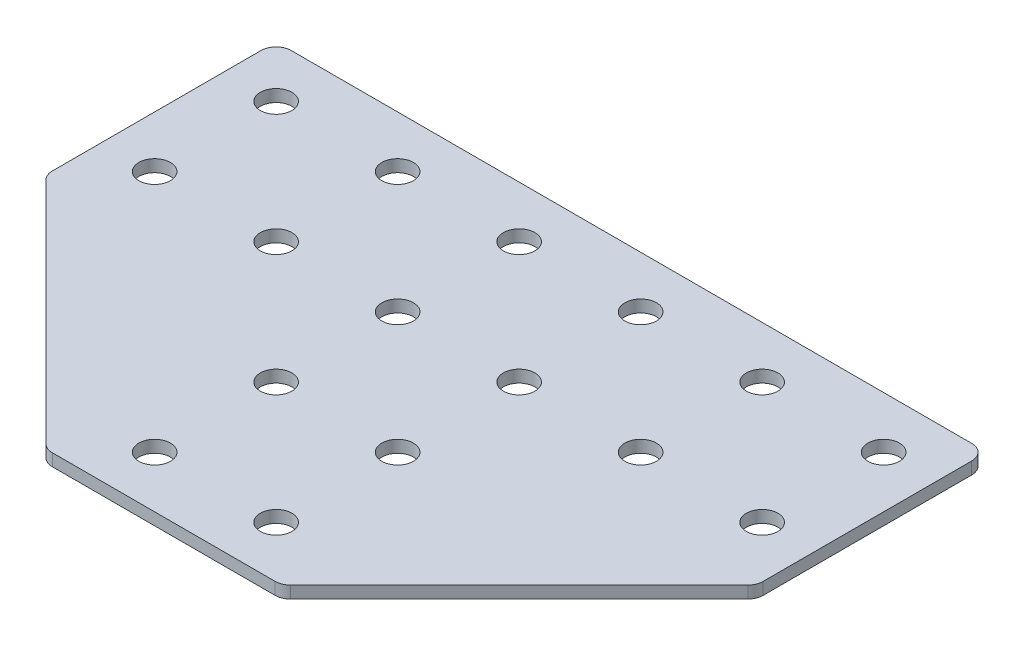
ISO-10303-21;
HEADER;
FILE_DESCRIPTION(('STEP AP214'),'2;1');
FILE_NAME('part.step','',(''),(''),'','','');
FILE_SCHEMA(('AUTOMOTIVE_DESIGN { 1 0 10303 214 1 1 1 1 }'));
ENDSEC;
DATA;
#1=APPLICATION_CONTEXT('core data for automotive mechanical design processes');
#2=APPLICATION_PROTOCOL_DEFINITION('international standard','automotive_design',2000,#1);
#3=PRODUCT_CONTEXT('',#1,'mechanical');
#4=PRODUCT('Part','Part','',(#3));
#5=PRODUCT_RELATED_PRODUCT_CATEGORY('part','',(#4));
#6=PRODUCT_DEFINITION_FORMATION('','',#4);
#7=PRODUCT_DEFINITION_CONTEXT('part definition',#1,'design');
#8=PRODUCT_DEFINITION('design','',#6,#7);
#9=PRODUCT_DEFINITION_SHAPE('','',#8);
#10=(LENGTH_UNIT() NAMED_UNIT(*) SI_UNIT(.MILLI.,.METRE.));
#11=(NAMED_UNIT(*) PLANE_ANGLE_UNIT() SI_UNIT($,.RADIAN.));
#12=(NAMED_UNIT(*) SI_UNIT($,.STERADIAN.) SOLID_ANGLE_UNIT());
#13=UNCERTAINTY_MEASURE_WITH_UNIT(LENGTH_MEASURE(1.E-05),#10,'distance_accuracy_value','');
#14=(GEOMETRIC_REPRESENTATION_CONTEXT(3) GLOBAL_UNCERTAINTY_ASSIGNED_CONTEXT((#13)) GLOBAL_UNIT_ASSIGNED_CONTEXT((#10,
#11,#12)) REPRESENTATION_CONTEXT('',''));
#15=CARTESIAN_POINT('',(0.,0.,0.));
#16=DIRECTION('',(0.,0.,1.));
#17=DIRECTION('',(1.,0.,0.));
#18=AXIS2_PLACEMENT_3D('',#15,#16,#17);
#19=CARTESIAN_POINT('',(-1.58311926747956,0.841431359707713,-20.2580128323757));
#20=DIRECTION('',(0.,-1.,0.));
#21=DIRECTION('',(0.,0.,-1.));
#22=AXIS2_PLACEMENT_3D('',#19,#20,#21);
#23=PLANE('',#22);
#24=DIRECTION('',(1.,0.,0.));
#25=VECTOR('',#24,1.);
#26=CARTESIAN_POINT('',(-20.0831192674796,0.841431359707713,38.2419871676243));
#27=LINE('',#26,#25);
#28=CARTESIAN_POINT('',(-19.9262650179872,0.841431359707713,38.2419871676243));
#29=VERTEX_POINT('',#28);
#30=CARTESIAN_POINT('',(16.7600264830281,0.841431359707713,38.2419871676243));
#31=VERTEX_POINT('',#30);
#32=EDGE_CURVE('E218',#29,#31,#27,.T.);
#33=ORIENTED_EDGE('',*,*,#32,.F.);
#34=CARTESIAN_POINT('',(-19.9262650179872,0.841431359707713,35.7419871676243));
#35=DIRECTION('',(0.,1.,0.));
#36=DIRECTION('',(0.,0.,-1.));
#37=AXIS2_PLACEMENT_3D('',#34,#35,#36);
#38=CIRCLE('',#37,2.5);
#39=CARTESIAN_POINT('',(-21.6940319709536,0.841431359707713,37.5097541205907));
#40=VERTEX_POINT('',#39);
#41=EDGE_CURVE('E154',#40,#29,#38,.T.);
#42=ORIENTED_EDGE('',*,*,#41,.F.);
#43=DIRECTION('',(-0.707106781186547,0.,-0.707106781186548));
#44=VECTOR('',#43,1.);
#45=CARTESIAN_POINT('',(-20.96179892392,0.841431359707713,38.2419871676243));
#46=LINE('',#45,#44);
#47=CARTESIAN_POINT('',(-59.3508862204459,0.841431359707713,-0.147100128901612));
#48=VERTEX_POINT('',#47);
#49=EDGE_CURVE('E141',#40,#48,#46,.T.);
#50=ORIENTED_EDGE('',*,*,#49,.T.);
#51=CARTESIAN_POINT('',(-57.5831192674795,0.841431359707713,-1.91486708186799));
#52=DIRECTION('',(0.,1.,0.));
#53=DIRECTION('',(0.,0.,-1.));
#54=AXIS2_PLACEMENT_3D('',#51,#52,#53);
#55=CIRCLE('',#54,2.5);
#56=CARTESIAN_POINT('',(-60.0831192674795,0.841431359707713,-1.91486708186798));
#57=VERTEX_POINT('',#56);
#58=EDGE_CURVE('E152',#57,#48,#55,.T.);
#59=ORIENTED_EDGE('',*,*,#58,.F.);
#60=DIRECTION('',(0.,0.,-1.));
#61=VECTOR('',#60,1.);
#62=CARTESIAN_POINT('',(-60.0831192674795,0.841431359707713,-0.879333175935252));
#63=LINE('',#62,#61);
#64=CARTESIAN_POINT('',(-60.0831192674795,0.841431359707713,-36.2580128323757));
#65=VERTEX_POINT('',#64);
#66=EDGE_CURVE('E124',#57,#65,#63,.T.);
#67=ORIENTED_EDGE('',*,*,#66,.T.);
#68=CARTESIAN_POINT('',(-57.5831192674795,0.841431359707713,-36.2580128323757));
#69=DIRECTION('',(0.,1.,0.));
#70=DIRECTION('',(0.,0.,-1.));
#71=AXIS2_PLACEMENT_3D('',#68,#69,#70);
#72=CIRCLE('',#71,2.5);
#73=CARTESIAN_POINT('',(-57.5831192674795,0.841431359707713,-38.7580128323757));
#74=VERTEX_POINT('',#73);
#75=EDGE_CURVE('E149',#74,#65,#72,.T.);
#76=ORIENTED_EDGE('',*,*,#75,.F.);
#77=DIRECTION('',(-1.,0.,0.));
#78=VECTOR('',#77,1.);
#79=CARTESIAN_POINT('',(56.9168807325204,0.841431359707713,-38.7580128323757));
#80=LINE('',#79,#78);
#81=CARTESIAN_POINT('',(54.4168807325204,0.841431359707713,-38.7580128323757));
#82=VERTEX_POINT('',#81);
#83=EDGE_CURVE('E215',#82,#74,#80,.T.);
#84=ORIENTED_EDGE('',*,*,#83,.F.);
#85=CARTESIAN_POINT('',(54.4168807325204,0.841431359707713,-36.2580128323757));
#86=DIRECTION('',(0.,-1.,0.));
#87=DIRECTION('',(0.,0.,-1.));
#88=AXIS2_PLACEMENT_3D('',#85,#86,#87);
#89=CIRCLE('',#88,2.5);
#90=CARTESIAN_POINT('',(56.9168807325204,0.841431359707713,-36.2580128323757));
#91=VERTEX_POINT('',#90);
#92=EDGE_CURVE('E239',#82,#91,#89,.T.);
#93=ORIENTED_EDGE('',*,*,#92,.T.);
#94=DIRECTION('',(0.,0.,-1.));
#95=VECTOR('',#94,1.);
#96=CARTESIAN_POINT('',(56.9168807325204,0.841431359707713,-0.879333175935269));
#97=LINE('',#96,#95);
#98=CARTESIAN_POINT('',(56.9168807325204,0.841431359707713,-1.914867081868));
#99=VERTEX_POINT('',#98);
#100=EDGE_CURVE('E212',#99,#91,#97,.T.);
#101=ORIENTED_EDGE('',*,*,#100,.F.);
#102=CARTESIAN_POINT('',(54.4168807325204,0.841431359707713,-1.914867081868));
#103=DIRECTION('',(0.,-1.,0.));
#104=DIRECTION('',(0.,0.,-1.));
#105=AXIS2_PLACEMENT_3D('',#102,#103,#104);
#106=CIRCLE('',#105,2.5);
#107=CARTESIAN_POINT('',(56.1846476854867,0.841431359707713,-0.14710012890163));
#108=VERTEX_POINT('',#107);
#109=EDGE_CURVE('E31',#99,#108,#106,.T.);
#110=ORIENTED_EDGE('',*,*,#109,.T.);
#111=DIRECTION('',(0.707106781186547,0.,-0.707106781186548));
#112=VECTOR('',#111,1.);
#113=CARTESIAN_POINT('',(17.7955603889609,0.841431359707713,38.2419871676243));
#114=LINE('',#113,#112);
#115=CARTESIAN_POINT('',(18.5277934359945,0.841431359707713,37.5097541205907));
#116=VERTEX_POINT('',#115);
#117=EDGE_CURVE('E220',#116,#108,#114,.T.);
#118=ORIENTED_EDGE('',*,*,#117,.F.);
#119=CARTESIAN_POINT('',(16.7600264830281,0.841431359707713,35.7419871676243));
#120=DIRECTION('',(0.,-1.,0.));
#121=DIRECTION('',(0.,0.,-1.));
#122=AXIS2_PLACEMENT_3D('',#119,#120,#121);
#123=CIRCLE('',#122,2.5);
#124=EDGE_CURVE('E242',#116,#31,#123,.T.);
#125=ORIENTED_EDGE('',*,*,#124,.T.);
#126=EDGE_LOOP('',(#33,#42,#50,#59,#67,#76,#84,#93,#101,#110,#118,#125));
#127=FACE_BOUND('',#126,.T.);
#128=CARTESIAN_POINT('',(48.4168807325204,0.841431359707713,-10.2580128323757));
#129=DIRECTION('',(0.,1.,0.));
#130=DIRECTION('',(0.,0.,1.));
#131=AXIS2_PLACEMENT_3D('',#128,#129,#130);
#132=CIRCLE('',#131,2.6);
#133=CARTESIAN_POINT('',(48.4168807325204,0.841431359707713,-7.65801283237568));
#134=VERTEX_POINT('',#133);
#135=EDGE_CURVE('E164',#134,#134,#132,.T.);
#136=ORIENTED_EDGE('',*,*,#135,.T.);
#137=EDGE_LOOP('',(#136));
#138=FACE_BOUND('',#137,.T.);
#139=CARTESIAN_POINT('',(28.4168807325204,0.841431359707713,-10.2580128323757));
#140=DIRECTION('',(0.,1.,0.));
#141=DIRECTION('',(0.,0.,1.));
#142=AXIS2_PLACEMENT_3D('',#139,#140,#141);
#143=CIRCLE('',#142,2.6);
#144=CARTESIAN_POINT('',(28.4168807325204,0.841431359707713,-7.65801283237565));
#145=VERTEX_POINT('',#144);
#146=EDGE_CURVE('E170',#145,#145,#143,.T.);
#147=ORIENTED_EDGE('',*,*,#146,.T.);
#148=EDGE_LOOP('',(#147));
#149=FACE_BOUND('',#148,.T.);
#150=CARTESIAN_POINT('',(8.41688073252045,0.841431359707713,29.7419871676243));
#151=DIRECTION('',(0.,1.,0.));
#152=DIRECTION('',(0.,0.,1.));
#153=AXIS2_PLACEMENT_3D('',#150,#151,#152);
#154=CIRCLE('',#153,2.6);
#155=CARTESIAN_POINT('',(8.41688073252045,0.841431359707713,32.3419871676243));
#156=VERTEX_POINT('',#155);
#157=EDGE_CURVE('E176',#156,#156,#154,.T.);
#158=ORIENTED_EDGE('',*,*,#157,.T.);
#159=EDGE_LOOP('',(#158));
#160=FACE_BOUND('',#159,.T.);
#161=CARTESIAN_POINT('',(8.41688073252045,0.841431359707713,9.74198716762433));
#162=DIRECTION('',(0.,1.,0.));
#163=DIRECTION('',(0.,0.,1.));
#164=AXIS2_PLACEMENT_3D('',#161,#162,#163);
#165=CIRCLE('',#164,2.6);
#166=CARTESIAN_POINT('',(8.41688073252045,0.841431359707713,12.3419871676243));
#167=VERTEX_POINT('',#166);
#168=EDGE_CURVE('E182',#167,#167,#165,.T.);
#169=ORIENTED_EDGE('',*,*,#168,.T.);
#170=EDGE_LOOP('',(#169));
#171=FACE_BOUND('',#170,.T.);
#172=CARTESIAN_POINT('',(8.41688073252041,0.841431359707713,-10.2580128323757));
#173=DIRECTION('',(0.,1.,0.));
#174=DIRECTION('',(0.,0.,1.));
#175=AXIS2_PLACEMENT_3D('',#172,#173,#174);
#176=CIRCLE('',#175,2.6);
#177=CARTESIAN_POINT('',(8.41688073252041,0.841431359707713,-7.65801283237566));
#178=VERTEX_POINT('',#177);
#179=EDGE_CURVE('E188',#178,#178,#176,.T.);
#180=ORIENTED_EDGE('',*,*,#179,.T.);
#181=EDGE_LOOP('',(#180));
#182=FACE_BOUND('',#181,.T.);
#183=CARTESIAN_POINT('',(48.4168807325204,0.841431359707713,-30.2580128323757));
#184=DIRECTION('',(0.,1.,0.));
#185=DIRECTION('',(0.,0.,1.));
#186=AXIS2_PLACEMENT_3D('',#183,#184,#185);
#187=CIRCLE('',#186,2.6);
#188=CARTESIAN_POINT('',(48.4168807325204,0.841431359707713,-27.6580128323757));
#189=VERTEX_POINT('',#188);
#190=EDGE_CURVE('E194',#189,#189,#187,.T.);
#191=ORIENTED_EDGE('',*,*,#190,.T.);
#192=EDGE_LOOP('',(#191));
#193=FACE_BOUND('',#192,.T.);
#194=CARTESIAN_POINT('',(28.4168807325204,0.841431359707713,-30.2580128323757));
#195=DIRECTION('',(0.,1.,0.));
#196=DIRECTION('',(0.,0.,1.));
#197=AXIS2_PLACEMENT_3D('',#194,#195,#196);
#198=CIRCLE('',#197,2.6);
#199=CARTESIAN_POINT('',(28.4168807325204,0.841431359707713,-27.6580128323757));
#200=VERTEX_POINT('',#199);
#201=EDGE_CURVE('E200',#200,#200,#198,.T.);
#202=ORIENTED_EDGE('',*,*,#201,.T.);
#203=EDGE_LOOP('',(#202));
#204=FACE_BOUND('',#203,.T.);
#205=CARTESIAN_POINT('',(8.41688073252041,0.841431359707713,-30.2580128323757));
#206=DIRECTION('',(0.,1.,0.));
#207=DIRECTION('',(0.,0.,1.));
#208=AXIS2_PLACEMENT_3D('',#205,#206,#207);
#209=CIRCLE('',#208,2.6);
#210=CARTESIAN_POINT('',(8.41688073252041,0.841431359707713,-27.6580128323757));
#211=VERTEX_POINT('',#210);
#212=EDGE_CURVE('E206',#211,#211,#209,.T.);
#213=ORIENTED_EDGE('',*,*,#212,.T.);
#214=EDGE_LOOP('',(#213));
#215=FACE_BOUND('',#214,.T.);
#216=CARTESIAN_POINT('',(-51.5831192674795,0.841431359707713,-10.2580128323757));
#217=DIRECTION('',(0.,-1.,0.));
#218=DIRECTION('',(0.,0.,1.));
#219=AXIS2_PLACEMENT_3D('',#216,#217,#218);
#220=CIRCLE('',#219,2.6);
#221=CARTESIAN_POINT('',(-51.5831192674795,0.841431359707713,-7.65801283237567));
#222=VERTEX_POINT('',#221);
#223=EDGE_CURVE('E318',#222,#222,#220,.T.);
#224=ORIENTED_EDGE('',*,*,#223,.F.);
#225=EDGE_LOOP('',(#224));
#226=FACE_BOUND('',#225,.T.);
#227=CARTESIAN_POINT('',(-31.5831192674795,0.841431359707713,-10.2580128323756));
#228=DIRECTION('',(0.,-1.,0.));
#229=DIRECTION('',(0.,0.,1.));
#230=AXIS2_PLACEMENT_3D('',#227,#228,#229);
#231=CIRCLE('',#230,2.6);
#232=CARTESIAN_POINT('',(-31.5831192674795,0.841431359707713,-7.65801283237565));
#233=VERTEX_POINT('',#232);
#234=EDGE_CURVE('E312',#233,#233,#231,.T.);
#235=ORIENTED_EDGE('',*,*,#234,.F.);
#236=EDGE_LOOP('',(#235));
#237=FACE_BOUND('',#236,.T.);
#238=CARTESIAN_POINT('',(-11.5831192674795,0.841431359707713,29.7419871676243));
#239=DIRECTION('',(0.,-1.,0.));
#240=DIRECTION('',(0.,0.,1.));
#241=AXIS2_PLACEMENT_3D('',#238,#239,#240);
#242=CIRCLE('',#241,2.6);
#243=CARTESIAN_POINT('',(-11.5831192674795,0.841431359707713,32.3419871676243));
#244=VERTEX_POINT('',#243);
#245=EDGE_CURVE('E306',#244,#244,#242,.T.);
#246=ORIENTED_EDGE('',*,*,#245,.F.);
#247=EDGE_LOOP('',(#246));
#248=FACE_BOUND('',#247,.T.);
#249=CARTESIAN_POINT('',(-11.5831192674796,0.841431359707713,9.74198716762433));
#250=DIRECTION('',(0.,-1.,0.));
#251=DIRECTION('',(0.,0.,1.));
#252=AXIS2_PLACEMENT_3D('',#249,#250,#251);
#253=CIRCLE('',#252,2.6);
#254=CARTESIAN_POINT('',(-11.5831192674796,0.841431359707713,12.3419871676243));
#255=VERTEX_POINT('',#254);
#256=EDGE_CURVE('E300',#255,#255,#253,.T.);
#257=ORIENTED_EDGE('',*,*,#256,.F.);
#258=EDGE_LOOP('',(#257));
#259=FACE_BOUND('',#258,.T.);
#260=CARTESIAN_POINT('',(-11.5831192674795,0.841431359707713,-10.2580128323757));
#261=DIRECTION('',(0.,-1.,0.));
#262=DIRECTION('',(0.,0.,1.));
#263=AXIS2_PLACEMENT_3D('',#260,#261,#262);
#264=CIRCLE('',#263,2.6);
#265=CARTESIAN_POINT('',(-11.5831192674795,0.841431359707713,-7.65801283237565));
#266=VERTEX_POINT('',#265);
#267=EDGE_CURVE('E294',#266,#266,#264,.T.);
#268=ORIENTED_EDGE('',*,*,#267,.F.);
#269=EDGE_LOOP('',(#268));
#270=FACE_BOUND('',#269,.T.);
#271=CARTESIAN_POINT('',(-51.5831192674795,0.841431359707713,-30.2580128323756));
#272=DIRECTION('',(0.,-1.,0.));
#273=DIRECTION('',(0.,0.,1.));
#274=AXIS2_PLACEMENT_3D('',#271,#272,#273);
#275=CIRCLE('',#274,2.6);
#276=CARTESIAN_POINT('',(-51.5831192674795,0.841431359707713,-27.6580128323756));
#277=VERTEX_POINT('',#276);
#278=EDGE_CURVE('E288',#277,#277,#275,.T.);
#279=ORIENTED_EDGE('',*,*,#278,.F.);
#280=EDGE_LOOP('',(#279));
#281=FACE_BOUND('',#280,.T.);
#282=CARTESIAN_POINT('',(-31.5831192674795,0.841431359707713,-30.2580128323756));
#283=DIRECTION('',(0.,-1.,0.));
#284=DIRECTION('',(0.,0.,1.));
#285=AXIS2_PLACEMENT_3D('',#282,#283,#284);
#286=CIRCLE('',#285,2.6);
#287=CARTESIAN_POINT('',(-31.5831192674795,0.841431359707713,-27.6580128323756));
#288=VERTEX_POINT('',#287);
#289=EDGE_CURVE('E283',#288,#288,#286,.T.);
#290=ORIENTED_EDGE('',*,*,#289,.F.);
#291=EDGE_LOOP('',(#290));
#292=FACE_BOUND('',#291,.T.);
#293=CARTESIAN_POINT('',(-11.5831192674795,0.841431359707713,-30.2580128323757));
#294=DIRECTION('',(0.,-1.,0.));
#295=DIRECTION('',(0.,0.,1.));
#296=AXIS2_PLACEMENT_3D('',#293,#294,#295);
#297=CIRCLE('',#296,2.6);
#298=CARTESIAN_POINT('',(-11.5831192674795,0.841431359707713,-27.6580128323757));
#299=VERTEX_POINT('',#298);
#300=EDGE_CURVE('E134',#299,#299,#297,.T.);
#301=ORIENTED_EDGE('',*,*,#300,.F.);
#302=EDGE_LOOP('',(#301));
#303=FACE_BOUND('',#302,.T.);
#304=ADVANCED_FACE('F16',(#127,#138,#149,#160,#171,#182,#193,#204,#215,#226,#237,#248,#259,#270,
#281,#292,#303),#23,.T.);
#305=CARTESIAN_POINT('',(56.9168807325204,0.841431359707713,-0.879333175935269));
#306=DIRECTION('',(1.,0.,0.));
#307=DIRECTION('',(0.,0.,-1.));
#308=AXIS2_PLACEMENT_3D('',#305,#306,#307);
#309=PLANE('',#308);
#310=DIRECTION('',(0.,0.,-1.));
#311=VECTOR('',#310,1.);
#312=CARTESIAN_POINT('',(56.9168807325204,2.84143135970771,-0.879333175935269));
#313=LINE('',#312,#311);
#314=CARTESIAN_POINT('',(56.9168807325204,2.84143135970771,-1.914867081868));
#315=VERTEX_POINT('',#314);
#316=CARTESIAN_POINT('',(56.9168807325204,2.84143135970771,-36.2580128323757));
#317=VERTEX_POINT('',#316);
#318=EDGE_CURVE('E209',#315,#317,#313,.T.);
#319=ORIENTED_EDGE('',*,*,#318,.F.);
#320=DIRECTION('',(0.,1.,0.));
#321=VECTOR('',#320,1.);
#322=CARTESIAN_POINT('',(56.9168807325204,0.841431359707713,-1.914867081868));
#323=LINE('',#322,#321);
#324=EDGE_CURVE('E24',#315,#99,#323,.F.);
#325=ORIENTED_EDGE('',*,*,#324,.T.);
#326=ORIENTED_EDGE('',*,*,#100,.T.);
#327=DIRECTION('',(0.,1.,0.));
#328=VECTOR('',#327,1.);
#329=CARTESIAN_POINT('',(56.9168807325204,0.841431359707713,-36.2580128323757));
#330=LINE('',#329,#328);
#331=EDGE_CURVE('E249',#91,#317,#330,.T.);
#332=ORIENTED_EDGE('',*,*,#331,.T.);
#333=EDGE_LOOP('',(#319,#325,#326,#332));
#334=FACE_BOUND('',#333,.T.);
#335=ADVANCED_FACE('F254',(#334),#309,.T.);
#336=CARTESIAN_POINT('',(17.7955603889609,0.841431359707713,38.2419871676243));
#337=DIRECTION('',(0.707106781186548,0.,0.707106781186547));
#338=DIRECTION('',(0.707106781186547,0.,-0.707106781186548));
#339=AXIS2_PLACEMENT_3D('',#336,#337,#338);
#340=PLANE('',#339);
#341=DIRECTION('',(0.707106781186547,0.,-0.707106781186548));
#342=VECTOR('',#341,1.);
#343=CARTESIAN_POINT('',(17.7955603889609,2.84143135970771,38.2419871676243));
#344=LINE('',#343,#342);
#345=CARTESIAN_POINT('',(18.5277934359945,2.84143135970771,37.5097541205907));
#346=VERTEX_POINT('',#345);
#347=CARTESIAN_POINT('',(56.1846476854867,2.84143135970771,-0.14710012890163));
#348=VERTEX_POINT('',#347);
#349=EDGE_CURVE('E216',#346,#348,#344,.T.);
#350=ORIENTED_EDGE('',*,*,#349,.F.);
#351=DIRECTION('',(0.,1.,0.));
#352=VECTOR('',#351,1.);
#353=CARTESIAN_POINT('',(18.5277934359945,0.841431359707713,37.5097541205907));
#354=LINE('',#353,#352);
#355=EDGE_CURVE('E38',#346,#116,#354,.F.);
#356=ORIENTED_EDGE('',*,*,#355,.T.);
#357=ORIENTED_EDGE('',*,*,#117,.T.);
#358=DIRECTION('',(0.,1.,0.));
#359=VECTOR('',#358,1.);
#360=CARTESIAN_POINT('',(56.1846476854868,0.841431359707713,-0.147100128901637));
#361=LINE('',#360,#359);
#362=EDGE_CURVE('E245',#108,#348,#361,.T.);
#363=ORIENTED_EDGE('',*,*,#362,.T.);
#364=EDGE_LOOP('',(#350,#356,#357,#363));
#365=FACE_BOUND('',#364,.T.);
#366=ADVANCED_FACE('F262',(#365),#340,.T.);
#367=CARTESIAN_POINT('',(-20.0831192674796,0.841431359707713,38.2419871676243));
#368=DIRECTION('',(0.,0.,1.));
#369=DIRECTION('',(1.,0.,0.));
#370=AXIS2_PLACEMENT_3D('',#367,#368,#369);
#371=PLANE('',#370);
#372=DIRECTION('',(1.,0.,0.));
#373=VECTOR('',#372,1.);
#374=CARTESIAN_POINT('',(-20.0831192674796,2.84143135970771,38.2419871676243));
#375=LINE('',#374,#373);
#376=CARTESIAN_POINT('',(-19.9262650179872,2.84143135970771,38.2419871676243));
#377=VERTEX_POINT('',#376);
#378=CARTESIAN_POINT('',(16.7600264830281,2.84143135970771,38.2419871676243));
#379=VERTEX_POINT('',#378);
#380=EDGE_CURVE('E227',#377,#379,#375,.T.);
#381=ORIENTED_EDGE('',*,*,#380,.F.);
#382=DIRECTION('',(0.,1.,0.));
#383=VECTOR('',#382,1.);
#384=CARTESIAN_POINT('',(-19.9262650179872,0.841431359707713,38.2419871676243));
#385=LINE('',#384,#383);
#386=EDGE_CURVE('E146',#29,#377,#385,.T.);
#387=ORIENTED_EDGE('',*,*,#386,.F.);
#388=ORIENTED_EDGE('',*,*,#32,.T.);
#389=DIRECTION('',(0.,1.,0.));
#390=VECTOR('',#389,1.);
#391=CARTESIAN_POINT('',(16.7600264830281,0.841431359707713,38.2419871676243));
#392=LINE('',#391,#390);
#393=EDGE_CURVE('E236',#31,#379,#392,.T.);
#394=ORIENTED_EDGE('',*,*,#393,.T.);
#395=EDGE_LOOP('',(#381,#387,#388,#394));
#396=FACE_BOUND('',#395,.T.);
#397=ADVANCED_FACE('F270',(#396),#371,.T.);
#398=CARTESIAN_POINT('',(56.9168807325204,0.841431359707713,-38.7580128323757));
#399=DIRECTION('',(0.,0.,-1.));
#400=DIRECTION('',(-1.,0.,0.));
#401=AXIS2_PLACEMENT_3D('',#398,#399,#400);
#402=PLANE('',#401);
#403=ORIENTED_EDGE('',*,*,#83,.T.);
#404=DIRECTION('',(0.,1.,0.));
#405=VECTOR('',#404,1.);
#406=CARTESIAN_POINT('',(-57.5831192674795,0.841431359707713,-38.7580128323757));
#407=LINE('',#406,#405);
#408=CARTESIAN_POINT('',(-57.5831192674795,2.84143135970771,-38.7580128323757));
#409=VERTEX_POINT('',#408);
#410=EDGE_CURVE('E126',#409,#74,#407,.F.);
#411=ORIENTED_EDGE('',*,*,#410,.F.);
#412=DIRECTION('',(-1.,0.,0.));
#413=VECTOR('',#412,1.);
#414=CARTESIAN_POINT('',(56.9168807325204,2.84143135970771,-38.7580128323757));
#415=LINE('',#414,#413);
#416=CARTESIAN_POINT('',(54.4168807325204,2.84143135970771,-38.7580128323757));
#417=VERTEX_POINT('',#416);
#418=EDGE_CURVE('E225',#417,#409,#415,.T.);
#419=ORIENTED_EDGE('',*,*,#418,.F.);
#420=DIRECTION('',(0.,1.,0.));
#421=VECTOR('',#420,1.);
#422=CARTESIAN_POINT('',(54.4168807325204,0.841431359707713,-38.7580128323757));
#423=LINE('',#422,#421);
#424=EDGE_CURVE('E10',#417,#82,#423,.F.);
#425=ORIENTED_EDGE('',*,*,#424,.T.);
#426=EDGE_LOOP('',(#403,#411,#419,#425));
#427=FACE_BOUND('',#426,.T.);
#428=ADVANCED_FACE('F356',(#427),#402,.T.);
#429=CARTESIAN_POINT('',(-1.58311926747956,2.84143135970771,-20.2580128323757));
#430=DIRECTION('',(0.,-1.,0.));
#431=DIRECTION('',(0.,0.,-1.));
#432=AXIS2_PLACEMENT_3D('',#429,#430,#431);
#433=PLANE('',#432);
#434=CARTESIAN_POINT('',(48.4168807325204,2.84143135970771,-10.2580128323757));
#435=DIRECTION('',(0.,1.,0.));
#436=DIRECTION('',(0.,0.,1.));
#437=AXIS2_PLACEMENT_3D('',#434,#435,#436);
#438=CIRCLE('',#437,2.6);
#439=CARTESIAN_POINT('',(48.4168807325204,2.84143135970771,-7.65801283237568));
#440=VERTEX_POINT('',#439);
#441=EDGE_CURVE('E163',#440,#440,#438,.T.);
#442=ORIENTED_EDGE('',*,*,#441,.F.);
#443=EDGE_LOOP('',(#442));
#444=FACE_BOUND('',#443,.T.);
#445=CARTESIAN_POINT('',(28.4168807325204,2.84143135970771,-10.2580128323757));
#446=DIRECTION('',(0.,1.,0.));
#447=DIRECTION('',(0.,0.,1.));
#448=AXIS2_PLACEMENT_3D('',#445,#446,#447);
#449=CIRCLE('',#448,2.6);
#450=CARTESIAN_POINT('',(28.4168807325204,2.84143135970771,-7.65801283237565));
#451=VERTEX_POINT('',#450);
#452=EDGE_CURVE('E167',#451,#451,#449,.T.);
#453=ORIENTED_EDGE('',*,*,#452,.F.);
#454=EDGE_LOOP('',(#453));
#455=FACE_BOUND('',#454,.T.);
#456=CARTESIAN_POINT('',(8.41688073252045,2.84143135970771,29.7419871676243));
#457=DIRECTION('',(0.,1.,0.));
#458=DIRECTION('',(0.,0.,1.));
#459=AXIS2_PLACEMENT_3D('',#456,#457,#458);
#460=CIRCLE('',#459,2.6);
#461=CARTESIAN_POINT('',(8.41688073252045,2.84143135970771,32.3419871676243));
#462=VERTEX_POINT('',#461);
#463=EDGE_CURVE('E173',#462,#462,#460,.T.);
#464=ORIENTED_EDGE('',*,*,#463,.F.);
#465=EDGE_LOOP('',(#464));
#466=FACE_BOUND('',#465,.T.);
#467=CARTESIAN_POINT('',(8.41688073252045,2.84143135970771,9.74198716762433));
#468=DIRECTION('',(0.,1.,0.));
#469=DIRECTION('',(0.,0.,1.));
#470=AXIS2_PLACEMENT_3D('',#467,#468,#469);
#471=CIRCLE('',#470,2.6);
#472=CARTESIAN_POINT('',(8.41688073252045,2.84143135970771,12.3419871676243));
#473=VERTEX_POINT('',#472);
#474=EDGE_CURVE('E179',#473,#473,#471,.T.);
#475=ORIENTED_EDGE('',*,*,#474,.F.);
#476=EDGE_LOOP('',(#475));
#477=FACE_BOUND('',#476,.T.);
#478=CARTESIAN_POINT('',(8.41688073252041,2.84143135970771,-10.2580128323757));
#479=DIRECTION('',(0.,1.,0.));
#480=DIRECTION('',(0.,0.,1.));
#481=AXIS2_PLACEMENT_3D('',#478,#479,#480);
#482=CIRCLE('',#481,2.6);
#483=CARTESIAN_POINT('',(8.41688073252041,2.84143135970771,-7.65801283237566));
#484=VERTEX_POINT('',#483);
#485=EDGE_CURVE('E185',#484,#484,#482,.T.);
#486=ORIENTED_EDGE('',*,*,#485,.F.);
#487=EDGE_LOOP('',(#486));
#488=FACE_BOUND('',#487,.T.);
#489=CARTESIAN_POINT('',(48.4168807325204,2.84143135970771,-30.2580128323757));
#490=DIRECTION('',(0.,1.,0.));
#491=DIRECTION('',(0.,0.,1.));
#492=AXIS2_PLACEMENT_3D('',#489,#490,#491);
#493=CIRCLE('',#492,2.6);
#494=CARTESIAN_POINT('',(48.4168807325204,2.84143135970771,-27.6580128323757));
#495=VERTEX_POINT('',#494);
#496=EDGE_CURVE('E191',#495,#495,#493,.T.);
#497=ORIENTED_EDGE('',*,*,#496,.F.);
#498=EDGE_LOOP('',(#497));
#499=FACE_BOUND('',#498,.T.);
#500=CARTESIAN_POINT('',(28.4168807325204,2.84143135970771,-30.2580128323757));
#501=DIRECTION('',(0.,1.,0.));
#502=DIRECTION('',(0.,0.,1.));
#503=AXIS2_PLACEMENT_3D('',#500,#501,#502);
#504=CIRCLE('',#503,2.6);
#505=CARTESIAN_POINT('',(28.4168807325204,2.84143135970771,-27.6580128323757));
#506=VERTEX_POINT('',#505);
#507=EDGE_CURVE('E197',#506,#506,#504,.T.);
#508=ORIENTED_EDGE('',*,*,#507,.F.);
#509=EDGE_LOOP('',(#508));
#510=FACE_BOUND('',#509,.T.);
#511=CARTESIAN_POINT('',(8.41688073252041,2.84143135970771,-30.2580128323757));
#512=DIRECTION('',(0.,1.,0.));
#513=DIRECTION('',(0.,0.,1.));
#514=AXIS2_PLACEMENT_3D('',#511,#512,#513);
#515=CIRCLE('',#514,2.6);
#516=CARTESIAN_POINT('',(8.41688073252041,2.84143135970771,-27.6580128323757));
#517=VERTEX_POINT('',#516);
#518=EDGE_CURVE('E203',#517,#517,#515,.T.);
#519=ORIENTED_EDGE('',*,*,#518,.F.);
#520=EDGE_LOOP('',(#519));
#521=FACE_BOUND('',#520,.T.);
#522=ORIENTED_EDGE('',*,*,#418,.T.);
#523=CARTESIAN_POINT('',(-57.5831192674795,2.84143135970771,-36.2580128323757));
#524=DIRECTION('',(0.,1.,0.));
#525=DIRECTION('',(0.,0.,-1.));
#526=AXIS2_PLACEMENT_3D('',#523,#524,#525);
#527=CIRCLE('',#526,2.5);
#528=CARTESIAN_POINT('',(-60.0831192674795,2.84143135970771,-36.2580128323757));
#529=VERTEX_POINT('',#528);
#530=EDGE_CURVE('E117',#529,#409,#527,.F.);
#531=ORIENTED_EDGE('',*,*,#530,.F.);
#532=DIRECTION('',(0.,0.,-1.));
#533=VECTOR('',#532,1.);
#534=CARTESIAN_POINT('',(-60.0831192674795,2.84143135970771,-0.879333175935252));
#535=LINE('',#534,#533);
#536=CARTESIAN_POINT('',(-60.0831192674795,2.84143135970771,-1.91486708186798));
#537=VERTEX_POINT('',#536);
#538=EDGE_CURVE('E122',#537,#529,#535,.T.);
#539=ORIENTED_EDGE('',*,*,#538,.F.);
#540=CARTESIAN_POINT('',(-57.5831192674795,2.84143135970771,-1.91486708186799));
#541=DIRECTION('',(0.,1.,0.));
#542=DIRECTION('',(0.,0.,-1.));
#543=AXIS2_PLACEMENT_3D('',#540,#541,#542);
#544=CIRCLE('',#543,2.5);
#545=CARTESIAN_POINT('',(-59.3508862204459,2.84143135970771,-0.147100128901612));
#546=VERTEX_POINT('',#545);
#547=EDGE_CURVE('E105',#546,#537,#544,.F.);
#548=ORIENTED_EDGE('',*,*,#547,.F.);
#549=DIRECTION('',(-0.707106781186547,0.,-0.707106781186548));
#550=VECTOR('',#549,1.);
#551=CARTESIAN_POINT('',(-20.96179892392,2.84143135970771,38.2419871676243));
#552=LINE('',#551,#550);
#553=CARTESIAN_POINT('',(-21.6940319709536,2.84143135970771,37.5097541205907));
#554=VERTEX_POINT('',#553);
#555=EDGE_CURVE('E133',#554,#546,#552,.T.);
#556=ORIENTED_EDGE('',*,*,#555,.F.);
#557=CARTESIAN_POINT('',(-19.9262650179872,2.84143135970771,35.7419871676243));
#558=DIRECTION('',(0.,1.,0.));
#559=DIRECTION('',(0.,0.,-1.));
#560=AXIS2_PLACEMENT_3D('',#557,#558,#559);
#561=CIRCLE('',#560,2.5);
#562=EDGE_CURVE('E116',#377,#554,#561,.F.);
#563=ORIENTED_EDGE('',*,*,#562,.F.);
#564=ORIENTED_EDGE('',*,*,#380,.T.);
#565=CARTESIAN_POINT('',(16.7600264830281,2.84143135970771,35.7419871676243));
#566=DIRECTION('',(0.,-1.,0.));
#567=DIRECTION('',(0.,0.,-1.));
#568=AXIS2_PLACEMENT_3D('',#565,#566,#567);
#569=CIRCLE('',#568,2.5);
#570=EDGE_CURVE('E234',#379,#346,#569,.F.);
#571=ORIENTED_EDGE('',*,*,#570,.T.);
#572=ORIENTED_EDGE('',*,*,#349,.T.);
#573=CARTESIAN_POINT('',(54.4168807325204,2.84143135970771,-1.914867081868));
#574=DIRECTION('',(0.,-1.,0.));
#575=DIRECTION('',(0.,0.,-1.));
#576=AXIS2_PLACEMENT_3D('',#573,#574,#575);
#577=CIRCLE('',#576,2.5);
#578=EDGE_CURVE('E232',#348,#315,#577,.F.);
#579=ORIENTED_EDGE('',*,*,#578,.T.);
#580=ORIENTED_EDGE('',*,*,#318,.T.);
#581=CARTESIAN_POINT('',(54.4168807325204,2.84143135970771,-36.2580128323757));
#582=DIRECTION('',(0.,-1.,0.));
#583=DIRECTION('',(0.,0.,-1.));
#584=AXIS2_PLACEMENT_3D('',#581,#582,#583);
#585=CIRCLE('',#584,2.5);
#586=EDGE_CURVE('E222',#317,#417,#585,.F.);
#587=ORIENTED_EDGE('',*,*,#586,.T.);
#588=EDGE_LOOP('',(#522,#531,#539,#548,#556,#563,#564,#571,#572,#579,#580,#587));
#589=FACE_BOUND('',#588,.T.);
#590=CARTESIAN_POINT('',(-51.5831192674795,2.84143135970771,-10.2580128323757));
#591=DIRECTION('',(0.,-1.,0.));
#592=DIRECTION('',(0.,0.,1.));
#593=AXIS2_PLACEMENT_3D('',#590,#591,#592);
#594=CIRCLE('',#593,2.6);
#595=CARTESIAN_POINT('',(-51.5831192674795,2.84143135970771,-7.65801283237567));
#596=VERTEX_POINT('',#595);
#597=EDGE_CURVE('E321',#596,#596,#594,.T.);
#598=ORIENTED_EDGE('',*,*,#597,.T.);
#599=EDGE_LOOP('',(#598));
#600=FACE_BOUND('',#599,.T.);
#601=CARTESIAN_POINT('',(-31.5831192674795,2.84143135970771,-10.2580128323756));
#602=DIRECTION('',(0.,-1.,0.));
#603=DIRECTION('',(0.,0.,1.));
#604=AXIS2_PLACEMENT_3D('',#601,#602,#603);
#605=CIRCLE('',#604,2.6);
#606=CARTESIAN_POINT('',(-31.5831192674795,2.84143135970771,-7.65801283237565));
#607=VERTEX_POINT('',#606);
#608=EDGE_CURVE('E315',#607,#607,#605,.T.);
#609=ORIENTED_EDGE('',*,*,#608,.T.);
#610=EDGE_LOOP('',(#609));
#611=FACE_BOUND('',#610,.T.);
#612=CARTESIAN_POINT('',(-11.5831192674795,2.84143135970771,29.7419871676243));
#613=DIRECTION('',(0.,-1.,0.));
#614=DIRECTION('',(0.,0.,1.));
#615=AXIS2_PLACEMENT_3D('',#612,#613,#614);
#616=CIRCLE('',#615,2.6);
#617=CARTESIAN_POINT('',(-11.5831192674795,2.84143135970771,32.3419871676243));
#618=VERTEX_POINT('',#617);
#619=EDGE_CURVE('E309',#618,#618,#616,.T.);
#620=ORIENTED_EDGE('',*,*,#619,.T.);
#621=EDGE_LOOP('',(#620));
#622=FACE_BOUND('',#621,.T.);
#623=CARTESIAN_POINT('',(-11.5831192674796,2.84143135970771,9.74198716762433));
#624=DIRECTION('',(0.,-1.,0.));
#625=DIRECTION('',(0.,0.,1.));
#626=AXIS2_PLACEMENT_3D('',#623,#624,#625);
#627=CIRCLE('',#626,2.6);
#628=CARTESIAN_POINT('',(-11.5831192674796,2.84143135970771,12.3419871676243));
#629=VERTEX_POINT('',#628);
#630=EDGE_CURVE('E303',#629,#629,#627,.T.);
#631=ORIENTED_EDGE('',*,*,#630,.T.);
#632=EDGE_LOOP('',(#631));
#633=FACE_BOUND('',#632,.T.);
#634=CARTESIAN_POINT('',(-11.5831192674795,2.84143135970771,-10.2580128323757));
#635=DIRECTION('',(0.,-1.,0.));
#636=DIRECTION('',(0.,0.,1.));
#637=AXIS2_PLACEMENT_3D('',#634,#635,#636);
#638=CIRCLE('',#637,2.6);
#639=CARTESIAN_POINT('',(-11.5831192674795,2.84143135970771,-7.65801283237565));
#640=VERTEX_POINT('',#639);
#641=EDGE_CURVE('E297',#640,#640,#638,.T.);
#642=ORIENTED_EDGE('',*,*,#641,.T.);
#643=EDGE_LOOP('',(#642));
#644=FACE_BOUND('',#643,.T.);
#645=CARTESIAN_POINT('',(-51.5831192674795,2.84143135970771,-30.2580128323756));
#646=DIRECTION('',(0.,-1.,0.));
#647=DIRECTION('',(0.,0.,1.));
#648=AXIS2_PLACEMENT_3D('',#645,#646,#647);
#649=CIRCLE('',#648,2.6);
#650=CARTESIAN_POINT('',(-51.5831192674795,2.84143135970771,-27.6580128323756));
#651=VERTEX_POINT('',#650);
#652=EDGE_CURVE('E291',#651,#651,#649,.T.);
#653=ORIENTED_EDGE('',*,*,#652,.T.);
#654=EDGE_LOOP('',(#653));
#655=FACE_BOUND('',#654,.T.);
#656=CARTESIAN_POINT('',(-31.5831192674795,2.84143135970771,-30.2580128323756));
#657=DIRECTION('',(0.,-1.,0.));
#658=DIRECTION('',(0.,0.,1.));
#659=AXIS2_PLACEMENT_3D('',#656,#657,#658);
#660=CIRCLE('',#659,2.6);
#661=CARTESIAN_POINT('',(-31.5831192674795,2.84143135970771,-27.6580128323756));
#662=VERTEX_POINT('',#661);
#663=EDGE_CURVE('E285',#662,#662,#660,.T.);
#664=ORIENTED_EDGE('',*,*,#663,.T.);
#665=EDGE_LOOP('',(#664));
#666=FACE_BOUND('',#665,.T.);
#667=CARTESIAN_POINT('',(-11.5831192674795,2.84143135970771,-30.2580128323757));
#668=DIRECTION('',(0.,-1.,0.));
#669=DIRECTION('',(0.,0.,1.));
#670=AXIS2_PLACEMENT_3D('',#667,#668,#669);
#671=CIRCLE('',#670,2.6);
#672=CARTESIAN_POINT('',(-11.5831192674795,2.84143135970771,-27.6580128323757));
#673=VERTEX_POINT('',#672);
#674=EDGE_CURVE('E138',#673,#673,#671,.T.);
#675=ORIENTED_EDGE('',*,*,#674,.T.);
#676=EDGE_LOOP('',(#675));
#677=FACE_BOUND('',#676,.T.);
#678=ADVANCED_FACE('F129',(#444,#455,#466,#477,#488,#499,#510,#521,#589,#600,#611,#622,#633,
#644,#655,#666,#677),#433,.F.);
#679=CARTESIAN_POINT('',(16.7600264830281,0.841431359707713,35.7419871676243));
#680=DIRECTION('',(0.,1.,0.));
#681=DIRECTION('',(0.,0.,1.));
#682=AXIS2_PLACEMENT_3D('',#679,#680,#681);
#683=CYLINDRICAL_SURFACE('',#682,2.5);
#684=ORIENTED_EDGE('',*,*,#124,.F.);
#685=ORIENTED_EDGE('',*,*,#355,.F.);
#686=ORIENTED_EDGE('',*,*,#570,.F.);
#687=ORIENTED_EDGE('',*,*,#393,.F.);
#688=EDGE_LOOP('',(#684,#685,#686,#687));
#689=FACE_BOUND('',#688,.T.);
#690=ADVANCED_FACE('F268',(#689),#683,.T.);
#691=CARTESIAN_POINT('',(54.4168807325204,0.841431359707713,-1.914867081868));
#692=DIRECTION('',(0.,1.,0.));
#693=DIRECTION('',(0.,0.,1.));
#694=AXIS2_PLACEMENT_3D('',#691,#692,#693);
#695=CYLINDRICAL_SURFACE('',#694,2.5);
#696=ORIENTED_EDGE('',*,*,#109,.F.);
#697=ORIENTED_EDGE('',*,*,#324,.F.);
#698=ORIENTED_EDGE('',*,*,#578,.F.);
#699=ORIENTED_EDGE('',*,*,#362,.F.);
#700=EDGE_LOOP('',(#696,#697,#698,#699));
#701=FACE_BOUND('',#700,.T.);
#702=ADVANCED_FACE('F261',(#701),#695,.T.);
#703=CARTESIAN_POINT('',(54.4168807325204,0.841431359707713,-36.2580128323757));
#704=DIRECTION('',(0.,1.,0.));
#705=DIRECTION('',(0.,0.,1.));
#706=AXIS2_PLACEMENT_3D('',#703,#704,#705);
#707=CYLINDRICAL_SURFACE('',#706,2.5);
#708=ORIENTED_EDGE('',*,*,#92,.F.);
#709=ORIENTED_EDGE('',*,*,#424,.F.);
#710=ORIENTED_EDGE('',*,*,#586,.F.);
#711=ORIENTED_EDGE('',*,*,#331,.F.);
#712=EDGE_LOOP('',(#708,#709,#710,#711));
#713=FACE_BOUND('',#712,.T.);
#714=ADVANCED_FACE('F18',(#713),#707,.T.);
#715=CARTESIAN_POINT('',(8.41688073252041,0.841431359707713,-30.2580128323757));
#716=DIRECTION('',(0.,1.,0.));
#717=DIRECTION('',(0.,0.,1.));
#718=AXIS2_PLACEMENT_3D('',#715,#716,#717);
#719=CYLINDRICAL_SURFACE('',#718,2.6);
#720=ORIENTED_EDGE('',*,*,#212,.F.);
#721=EDGE_LOOP('',(#720));
#722=FACE_BOUND('',#721,.T.);
#723=ORIENTED_EDGE('',*,*,#518,.T.);
#724=EDGE_LOOP('',(#723));
#725=FACE_BOUND('',#724,.T.);
#726=ADVANCED_FACE('F374',(#722,#725),#719,.F.);
#727=CARTESIAN_POINT('',(28.4168807325204,0.841431359707713,-30.2580128323757));
#728=DIRECTION('',(0.,1.,0.));
#729=DIRECTION('',(0.,0.,1.));
#730=AXIS2_PLACEMENT_3D('',#727,#728,#729);
#731=CYLINDRICAL_SURFACE('',#730,2.6);
#732=ORIENTED_EDGE('',*,*,#201,.F.);
#733=EDGE_LOOP('',(#732));
#734=FACE_BOUND('',#733,.T.);
#735=ORIENTED_EDGE('',*,*,#507,.T.);
#736=EDGE_LOOP('',(#735));
#737=FACE_BOUND('',#736,.T.);
#738=ADVANCED_FACE('F379',(#734,#737),#731,.F.);
#739=CARTESIAN_POINT('',(48.4168807325204,0.841431359707713,-30.2580128323757));
#740=DIRECTION('',(0.,1.,0.));
#741=DIRECTION('',(0.,0.,1.));
#742=AXIS2_PLACEMENT_3D('',#739,#740,#741);
#743=CYLINDRICAL_SURFACE('',#742,2.6);
#744=ORIENTED_EDGE('',*,*,#190,.F.);
#745=EDGE_LOOP('',(#744));
#746=FACE_BOUND('',#745,.T.);
#747=ORIENTED_EDGE('',*,*,#496,.T.);
#748=EDGE_LOOP('',(#747));
#749=FACE_BOUND('',#748,.T.);
#750=ADVANCED_FACE('F413',(#746,#749),#743,.F.);
#751=CARTESIAN_POINT('',(8.41688073252041,0.841431359707713,-10.2580128323757));
#752=DIRECTION('',(0.,1.,0.));
#753=DIRECTION('',(0.,0.,1.));
#754=AXIS2_PLACEMENT_3D('',#751,#752,#753);
#755=CYLINDRICAL_SURFACE('',#754,2.6);
#756=ORIENTED_EDGE('',*,*,#179,.F.);
#757=EDGE_LOOP('',(#756));
#758=FACE_BOUND('',#757,.T.);
#759=ORIENTED_EDGE('',*,*,#485,.T.);
#760=EDGE_LOOP('',(#759));
#761=FACE_BOUND('',#760,.T.);
#762=ADVANCED_FACE('F409',(#758,#761),#755,.F.);
#763=CARTESIAN_POINT('',(8.41688073252045,0.841431359707713,9.74198716762433));
#764=DIRECTION('',(0.,1.,0.));
#765=DIRECTION('',(0.,0.,1.));
#766=AXIS2_PLACEMENT_3D('',#763,#764,#765);
#767=CYLINDRICAL_SURFACE('',#766,2.6);
#768=ORIENTED_EDGE('',*,*,#168,.F.);
#769=EDGE_LOOP('',(#768));
#770=FACE_BOUND('',#769,.T.);
#771=ORIENTED_EDGE('',*,*,#474,.T.);
#772=EDGE_LOOP('',(#771));
#773=FACE_BOUND('',#772,.T.);
#774=ADVANCED_FACE('F405',(#770,#773),#767,.F.);
#775=CARTESIAN_POINT('',(8.41688073252045,0.841431359707713,29.7419871676243));
#776=DIRECTION('',(0.,1.,0.));
#777=DIRECTION('',(0.,0.,1.));
#778=AXIS2_PLACEMENT_3D('',#775,#776,#777);
#779=CYLINDRICAL_SURFACE('',#778,2.6);
#780=ORIENTED_EDGE('',*,*,#157,.F.);
#781=EDGE_LOOP('',(#780));
#782=FACE_BOUND('',#781,.T.);
#783=ORIENTED_EDGE('',*,*,#463,.T.);
#784=EDGE_LOOP('',(#783));
#785=FACE_BOUND('',#784,.T.);
#786=ADVANCED_FACE('F401',(#782,#785),#779,.F.);
#787=CARTESIAN_POINT('',(28.4168807325204,0.841431359707713,-10.2580128323757));
#788=DIRECTION('',(0.,1.,0.));
#789=DIRECTION('',(0.,0.,1.));
#790=AXIS2_PLACEMENT_3D('',#787,#788,#789);
#791=CYLINDRICAL_SURFACE('',#790,2.6);
#792=ORIENTED_EDGE('',*,*,#146,.F.);
#793=EDGE_LOOP('',(#792));
#794=FACE_BOUND('',#793,.T.);
#795=ORIENTED_EDGE('',*,*,#452,.T.);
#796=EDGE_LOOP('',(#795));
#797=FACE_BOUND('',#796,.T.);
#798=ADVANCED_FACE('F397',(#794,#797),#791,.F.);
#799=CARTESIAN_POINT('',(48.4168807325204,0.841431359707713,-10.2580128323757));
#800=DIRECTION('',(0.,1.,0.));
#801=DIRECTION('',(0.,0.,1.));
#802=AXIS2_PLACEMENT_3D('',#799,#800,#801);
#803=CYLINDRICAL_SURFACE('',#802,2.6);
#804=ORIENTED_EDGE('',*,*,#135,.F.);
#805=EDGE_LOOP('',(#804));
#806=FACE_BOUND('',#805,.T.);
#807=ORIENTED_EDGE('',*,*,#441,.T.);
#808=EDGE_LOOP('',(#807));
#809=FACE_BOUND('',#808,.T.);
#810=ADVANCED_FACE('F394',(#806,#809),#803,.F.);
#811=CARTESIAN_POINT('',(-60.0831192674795,0.841431359707713,-0.879333175935252));
#812=DIRECTION('',(-1.,0.,0.));
#813=DIRECTION('',(0.,0.,-1.));
#814=AXIS2_PLACEMENT_3D('',#811,#812,#813);
#815=PLANE('',#814);
#816=ORIENTED_EDGE('',*,*,#538,.T.);
#817=DIRECTION('',(0.,1.,0.));
#818=VECTOR('',#817,1.);
#819=CARTESIAN_POINT('',(-60.0831192674795,0.841431359707713,-36.2580128323757));
#820=LINE('',#819,#818);
#821=EDGE_CURVE('E127',#65,#529,#820,.T.);
#822=ORIENTED_EDGE('',*,*,#821,.F.);
#823=ORIENTED_EDGE('',*,*,#66,.F.);
#824=DIRECTION('',(0.,1.,0.));
#825=VECTOR('',#824,1.);
#826=CARTESIAN_POINT('',(-60.0831192674795,0.841431359707713,-1.91486708186798));
#827=LINE('',#826,#825);
#828=EDGE_CURVE('E109',#537,#57,#827,.F.);
#829=ORIENTED_EDGE('',*,*,#828,.F.);
#830=EDGE_LOOP('',(#816,#822,#823,#829));
#831=FACE_BOUND('',#830,.T.);
#832=ADVANCED_FACE('F121',(#831),#815,.T.);
#833=CARTESIAN_POINT('',(-20.96179892392,0.841431359707713,38.2419871676243));
#834=DIRECTION('',(-0.707106781186548,0.,0.707106781186547));
#835=DIRECTION('',(-0.707106781186547,0.,-0.707106781186548));
#836=AXIS2_PLACEMENT_3D('',#833,#834,#835);
#837=PLANE('',#836);
#838=ORIENTED_EDGE('',*,*,#555,.T.);
#839=DIRECTION('',(0.,1.,0.));
#840=VECTOR('',#839,1.);
#841=CARTESIAN_POINT('',(-59.3508862204459,0.841431359707713,-0.147100128901619));
#842=LINE('',#841,#840);
#843=EDGE_CURVE('E111',#48,#546,#842,.T.);
#844=ORIENTED_EDGE('',*,*,#843,.F.);
#845=ORIENTED_EDGE('',*,*,#49,.F.);
#846=DIRECTION('',(0.,1.,0.));
#847=VECTOR('',#846,1.);
#848=CARTESIAN_POINT('',(-21.6940319709536,0.841431359707713,37.5097541205907));
#849=LINE('',#848,#847);
#850=EDGE_CURVE('E158',#554,#40,#849,.F.);
#851=ORIENTED_EDGE('',*,*,#850,.F.);
#852=EDGE_LOOP('',(#838,#844,#845,#851));
#853=FACE_BOUND('',#852,.T.);
#854=ADVANCED_FACE('F279',(#853),#837,.T.);
#855=CARTESIAN_POINT('',(-19.9262650179872,0.841431359707713,35.7419871676243));
#856=DIRECTION('',(0.,1.,0.));
#857=DIRECTION('',(0.,0.,1.));
#858=AXIS2_PLACEMENT_3D('',#855,#856,#857);
#859=CYLINDRICAL_SURFACE('',#858,2.5);
#860=ORIENTED_EDGE('',*,*,#41,.T.);
#861=ORIENTED_EDGE('',*,*,#386,.T.);
#862=ORIENTED_EDGE('',*,*,#562,.T.);
#863=ORIENTED_EDGE('',*,*,#850,.T.);
#864=EDGE_LOOP('',(#860,#861,#862,#863));
#865=FACE_BOUND('',#864,.T.);
#866=ADVANCED_FACE('F276',(#865),#859,.T.);
#867=CARTESIAN_POINT('',(-57.5831192674795,0.841431359707713,-1.91486708186799));
#868=DIRECTION('',(0.,1.,0.));
#869=DIRECTION('',(0.,0.,1.));
#870=AXIS2_PLACEMENT_3D('',#867,#868,#869);
#871=CYLINDRICAL_SURFACE('',#870,2.5);
#872=ORIENTED_EDGE('',*,*,#58,.T.);
#873=ORIENTED_EDGE('',*,*,#843,.T.);
#874=ORIENTED_EDGE('',*,*,#547,.T.);
#875=ORIENTED_EDGE('',*,*,#828,.T.);
#876=EDGE_LOOP('',(#872,#873,#874,#875));
#877=FACE_BOUND('',#876,.T.);
#878=ADVANCED_FACE('F108',(#877),#871,.T.);
#879=CARTESIAN_POINT('',(-57.5831192674795,0.841431359707713,-36.2580128323757));
#880=DIRECTION('',(0.,1.,0.));
#881=DIRECTION('',(0.,0.,1.));
#882=AXIS2_PLACEMENT_3D('',#879,#880,#881);
#883=CYLINDRICAL_SURFACE('',#882,2.5);
#884=ORIENTED_EDGE('',*,*,#75,.T.);
#885=ORIENTED_EDGE('',*,*,#821,.T.);
#886=ORIENTED_EDGE('',*,*,#530,.T.);
#887=ORIENTED_EDGE('',*,*,#410,.T.);
#888=EDGE_LOOP('',(#884,#885,#886,#887));
#889=FACE_BOUND('',#888,.T.);
#890=ADVANCED_FACE('F351',(#889),#883,.T.);
#891=CARTESIAN_POINT('',(-11.5831192674795,0.841431359707713,-30.2580128323757));
#892=DIRECTION('',(0.,1.,0.));
#893=DIRECTION('',(0.,0.,1.));
#894=AXIS2_PLACEMENT_3D('',#891,#892,#893);
#895=CYLINDRICAL_SURFACE('',#894,2.6);
#896=ORIENTED_EDGE('',*,*,#300,.T.);
#897=EDGE_LOOP('',(#896));
#898=FACE_BOUND('',#897,.T.);
#899=ORIENTED_EDGE('',*,*,#674,.F.);
#900=EDGE_LOOP('',(#899));
#901=FACE_BOUND('',#900,.T.);
#902=ADVANCED_FACE('F347',(#898,#901),#895,.F.);
#903=CARTESIAN_POINT('',(-31.5831192674795,0.841431359707713,-30.2580128323756));
#904=DIRECTION('',(0.,1.,0.));
#905=DIRECTION('',(0.,0.,1.));
#906=AXIS2_PLACEMENT_3D('',#903,#904,#905);
#907=CYLINDRICAL_SURFACE('',#906,2.6);
#908=ORIENTED_EDGE('',*,*,#289,.T.);
#909=EDGE_LOOP('',(#908));
#910=FACE_BOUND('',#909,.T.);
#911=ORIENTED_EDGE('',*,*,#663,.F.);
#912=EDGE_LOOP('',(#911));
#913=FACE_BOUND('',#912,.T.);
#914=ADVANCED_FACE('F350',(#910,#913),#907,.F.);
#915=CARTESIAN_POINT('',(-51.5831192674795,0.841431359707713,-30.2580128323756));
#916=DIRECTION('',(0.,1.,0.));
#917=DIRECTION('',(0.,0.,1.));
#918=AXIS2_PLACEMENT_3D('',#915,#916,#917);
#919=CYLINDRICAL_SURFACE('',#918,2.6);
#920=ORIENTED_EDGE('',*,*,#278,.T.);
#921=EDGE_LOOP('',(#920));
#922=FACE_BOUND('',#921,.T.);
#923=ORIENTED_EDGE('',*,*,#652,.F.);
#924=EDGE_LOOP('',(#923));
#925=FACE_BOUND('',#924,.T.);
#926=ADVANCED_FACE('F552',(#922,#925),#919,.F.);
#927=CARTESIAN_POINT('',(-11.5831192674795,0.841431359707713,-10.2580128323757));
#928=DIRECTION('',(0.,1.,0.));
#929=DIRECTION('',(0.,0.,1.));
#930=AXIS2_PLACEMENT_3D('',#927,#928,#929);
#931=CYLINDRICAL_SURFACE('',#930,2.6);
#932=ORIENTED_EDGE('',*,*,#267,.T.);
#933=EDGE_LOOP('',(#932));
#934=FACE_BOUND('',#933,.T.);
#935=ORIENTED_EDGE('',*,*,#641,.F.);
#936=EDGE_LOOP('',(#935));
#937=FACE_BOUND('',#936,.T.);
#938=ADVANCED_FACE('F562',(#934,#937),#931,.F.);
#939=CARTESIAN_POINT('',(-11.5831192674796,0.841431359707713,9.74198716762433));
#940=DIRECTION('',(0.,1.,0.));
#941=DIRECTION('',(0.,0.,1.));
#942=AXIS2_PLACEMENT_3D('',#939,#940,#941);
#943=CYLINDRICAL_SURFACE('',#942,2.6);
#944=ORIENTED_EDGE('',*,*,#256,.T.);
#945=EDGE_LOOP('',(#944));
#946=FACE_BOUND('',#945,.T.);
#947=ORIENTED_EDGE('',*,*,#630,.F.);
#948=EDGE_LOOP('',(#947));
#949=FACE_BOUND('',#948,.T.);
#950=ADVANCED_FACE('F572',(#946,#949),#943,.F.);
#951=CARTESIAN_POINT('',(-11.5831192674795,0.841431359707713,29.7419871676243));
#952=DIRECTION('',(0.,1.,0.));
#953=DIRECTION('',(0.,0.,1.));
#954=AXIS2_PLACEMENT_3D('',#951,#952,#953);
#955=CYLINDRICAL_SURFACE('',#954,2.6);
#956=ORIENTED_EDGE('',*,*,#245,.T.);
#957=EDGE_LOOP('',(#956));
#958=FACE_BOUND('',#957,.T.);
#959=ORIENTED_EDGE('',*,*,#619,.F.);
#960=EDGE_LOOP('',(#959));
#961=FACE_BOUND('',#960,.T.);
#962=ADVANCED_FACE('F582',(#958,#961),#955,.F.);
#963=CARTESIAN_POINT('',(-31.5831192674795,0.841431359707713,-10.2580128323756));
#964=DIRECTION('',(0.,1.,0.));
#965=DIRECTION('',(0.,0.,1.));
#966=AXIS2_PLACEMENT_3D('',#963,#964,#965);
#967=CYLINDRICAL_SURFACE('',#966,2.6);
#968=ORIENTED_EDGE('',*,*,#234,.T.);
#969=EDGE_LOOP('',(#968));
#970=FACE_BOUND('',#969,.T.);
#971=ORIENTED_EDGE('',*,*,#608,.F.);
#972=EDGE_LOOP('',(#971));
#973=FACE_BOUND('',#972,.T.);
#974=ADVANCED_FACE('F592',(#970,#973),#967,.F.);
#975=CARTESIAN_POINT('',(-51.5831192674795,0.841431359707713,-10.2580128323757));
#976=DIRECTION('',(0.,1.,0.));
#977=DIRECTION('',(0.,0.,1.));
#978=AXIS2_PLACEMENT_3D('',#975,#976,#977);
#979=CYLINDRICAL_SURFACE('',#978,2.6);
#980=ORIENTED_EDGE('',*,*,#223,.T.);
#981=EDGE_LOOP('',(#980));
#982=FACE_BOUND('',#981,.T.);
#983=ORIENTED_EDGE('',*,*,#597,.F.);
#984=EDGE_LOOP('',(#983));
#985=FACE_BOUND('',#984,.T.);
#986=ADVANCED_FACE('F327',(#982,#985),#979,.F.);
#987=CLOSED_SHELL('',(#304,#335,#366,#397,#428,#678,#690,#702,#714,#726,#738,#750,#762,#774,
#786,#798,#810,#832,#854,#866,#878,#890,#902,#914,#926,#938,#950,#962,#974,#986));
#988=MANIFOLD_SOLID_BREP('B1',#987);
#989=ADVANCED_BREP_SHAPE_REPRESENTATION('',(#18,#988),#14);
#990=SHAPE_DEFINITION_REPRESENTATION(#9,#989);
ENDSEC;
END-ISO-10303-21;
